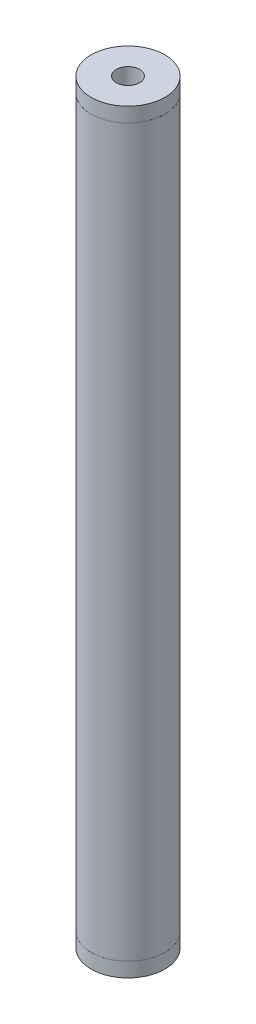
ISO-10303-21;
HEADER;
FILE_DESCRIPTION(('STEP AP214'),'2;1');
FILE_NAME('part.step','',(''),(''),'','','');
FILE_SCHEMA(('AUTOMOTIVE_DESIGN { 1 0 10303 214 1 1 1 1 }'));
ENDSEC;
DATA;
#1=APPLICATION_CONTEXT('core data for automotive mechanical design processes');
#2=APPLICATION_PROTOCOL_DEFINITION('international standard','automotive_design',2000,#1);
#3=PRODUCT_CONTEXT('',#1,'mechanical');
#4=PRODUCT('Part','Part','',(#3));
#5=PRODUCT_RELATED_PRODUCT_CATEGORY('part','',(#4));
#6=PRODUCT_DEFINITION_FORMATION('','',#4);
#7=PRODUCT_DEFINITION_CONTEXT('part definition',#1,'design');
#8=PRODUCT_DEFINITION('design','',#6,#7);
#9=PRODUCT_DEFINITION_SHAPE('','',#8);
#10=(LENGTH_UNIT() NAMED_UNIT(*) SI_UNIT(.MILLI.,.METRE.));
#11=(NAMED_UNIT(*) PLANE_ANGLE_UNIT() SI_UNIT($,.RADIAN.));
#12=(NAMED_UNIT(*) SI_UNIT($,.STERADIAN.) SOLID_ANGLE_UNIT());
#13=UNCERTAINTY_MEASURE_WITH_UNIT(LENGTH_MEASURE(1.E-05),#10,'distance_accuracy_value','');
#14=(GEOMETRIC_REPRESENTATION_CONTEXT(3) GLOBAL_UNCERTAINTY_ASSIGNED_CONTEXT((#13)) GLOBAL_UNIT_ASSIGNED_CONTEXT((#10,
#11,#12)) REPRESENTATION_CONTEXT('',''));
#15=CARTESIAN_POINT('',(0.,0.,0.));
#16=DIRECTION('',(0.,0.,1.));
#17=DIRECTION('',(1.,0.,0.));
#18=AXIS2_PLACEMENT_3D('',#15,#16,#17);
#19=CARTESIAN_POINT('',(25.4,-10.,0.));
#20=DIRECTION('',(0.,-1.,0.));
#21=DIRECTION('',(0.,0.,-1.));
#22=AXIS2_PLACEMENT_3D('',#19,#20,#21);
#23=PLANE('',#22);
#24=CARTESIAN_POINT('',(0.,-10.,0.));
#25=DIRECTION('',(0.,-1.,0.));
#26=DIRECTION('',(0.,0.,-1.));
#27=AXIS2_PLACEMENT_3D('',#24,#25,#26);
#28=CIRCLE('',#27,25.4);
#29=CARTESIAN_POINT('',(0.,-10.,-25.4));
#30=VERTEX_POINT('',#29);
#31=EDGE_CURVE('E62',#30,#30,#28,.T.);
#32=ORIENTED_EDGE('',*,*,#31,.T.);
#33=EDGE_LOOP('',(#32));
#34=FACE_BOUND('',#33,.T.);
#35=CARTESIAN_POINT('',(0.,-10.,0.));
#36=DIRECTION('',(0.,-1.,0.));
#37=DIRECTION('',(0.,0.,-1.));
#38=AXIS2_PLACEMENT_3D('',#35,#36,#37);
#39=CIRCLE('',#38,8.);
#40=CARTESIAN_POINT('',(0.,-10.,-8.));
#41=VERTEX_POINT('',#40);
#42=EDGE_CURVE('E11',#41,#41,#39,.T.);
#43=ORIENTED_EDGE('',*,*,#42,.F.);
#44=EDGE_LOOP('',(#43));
#45=FACE_BOUND('',#44,.T.);
#46=ADVANCED_FACE('F40',(#34,#45),#23,.T.);
#47=CARTESIAN_POINT('',(0.,0.,0.));
#48=DIRECTION('',(0.,-1.,0.));
#49=DIRECTION('',(0.,0.,-1.));
#50=AXIS2_PLACEMENT_3D('',#47,#48,#49);
#51=CYLINDRICAL_SURFACE('',#50,8.);
#52=ORIENTED_EDGE('',*,*,#42,.T.);
#53=EDGE_LOOP('',(#52));
#54=FACE_BOUND('',#53,.T.);
#55=CARTESIAN_POINT('',(0.,40.,0.));
#56=DIRECTION('',(0.,-1.,0.));
#57=DIRECTION('',(0.,0.,-1.));
#58=AXIS2_PLACEMENT_3D('',#55,#56,#57);
#59=CIRCLE('',#58,8.00000000000001);
#60=CARTESIAN_POINT('',(0.,40.,-8.00000000000001));
#61=VERTEX_POINT('',#60);
#62=EDGE_CURVE('E46',#61,#61,#59,.T.);
#63=ORIENTED_EDGE('',*,*,#62,.F.);
#64=EDGE_LOOP('',(#63));
#65=FACE_BOUND('',#64,.T.);
#66=ADVANCED_FACE('F80',(#54,#65),#51,.F.);
#67=CARTESIAN_POINT('',(8.00000000000001,40.,0.));
#68=DIRECTION('',(0.,1.,0.));
#69=DIRECTION('',(0.,0.,1.));
#70=AXIS2_PLACEMENT_3D('',#67,#68,#69);
#71=PLANE('',#70);
#72=ORIENTED_EDGE('',*,*,#62,.T.);
#73=EDGE_LOOP('',(#72));
#74=FACE_BOUND('',#73,.T.);
#75=CARTESIAN_POINT('',(0.,40.,0.));
#76=DIRECTION('',(0.,-1.,0.));
#77=DIRECTION('',(0.,0.,-1.));
#78=AXIS2_PLACEMENT_3D('',#75,#76,#77);
#79=CIRCLE('',#78,21.65);
#80=CARTESIAN_POINT('',(0.,40.,-21.65));
#81=VERTEX_POINT('',#80);
#82=EDGE_CURVE('E50',#81,#81,#79,.T.);
#83=ORIENTED_EDGE('',*,*,#82,.F.);
#84=EDGE_LOOP('',(#83));
#85=FACE_BOUND('',#84,.T.);
#86=ADVANCED_FACE('F84',(#74,#85),#71,.T.);
#87=CARTESIAN_POINT('',(0.,0.,0.));
#88=DIRECTION('',(0.,-1.,0.));
#89=DIRECTION('',(0.,0.,-1.));
#90=AXIS2_PLACEMENT_3D('',#87,#88,#89);
#91=CYLINDRICAL_SURFACE('',#90,21.65);
#92=ORIENTED_EDGE('',*,*,#82,.T.);
#93=EDGE_LOOP('',(#92));
#94=FACE_BOUND('',#93,.T.);
#95=CARTESIAN_POINT('',(0.,0.,0.));
#96=DIRECTION('',(0.,-1.,0.));
#97=DIRECTION('',(0.,0.,-1.));
#98=AXIS2_PLACEMENT_3D('',#95,#96,#97);
#99=CIRCLE('',#98,21.65);
#100=CARTESIAN_POINT('',(0.,0.,-21.65));
#101=VERTEX_POINT('',#100);
#102=EDGE_CURVE('E54',#101,#101,#99,.T.);
#103=ORIENTED_EDGE('',*,*,#102,.F.);
#104=EDGE_LOOP('',(#103));
#105=FACE_BOUND('',#104,.T.);
#106=ADVANCED_FACE('F76',(#94,#105),#91,.T.);
#107=CARTESIAN_POINT('',(21.65,0.,0.));
#108=DIRECTION('',(0.,1.,0.));
#109=DIRECTION('',(0.,0.,1.));
#110=AXIS2_PLACEMENT_3D('',#107,#108,#109);
#111=PLANE('',#110);
#112=ORIENTED_EDGE('',*,*,#102,.T.);
#113=EDGE_LOOP('',(#112));
#114=FACE_BOUND('',#113,.T.);
#115=CARTESIAN_POINT('',(0.,0.,0.));
#116=DIRECTION('',(0.,-1.,0.));
#117=DIRECTION('',(0.,0.,-1.));
#118=AXIS2_PLACEMENT_3D('',#115,#116,#117);
#119=CIRCLE('',#118,25.4);
#120=CARTESIAN_POINT('',(0.,0.,-25.4));
#121=VERTEX_POINT('',#120);
#122=EDGE_CURVE('E59',#121,#121,#119,.T.);
#123=ORIENTED_EDGE('',*,*,#122,.F.);
#124=EDGE_LOOP('',(#123));
#125=FACE_BOUND('',#124,.T.);
#126=ADVANCED_FACE('F70',(#114,#125),#111,.T.);
#127=CARTESIAN_POINT('',(0.,0.,0.));
#128=DIRECTION('',(0.,-1.,0.));
#129=DIRECTION('',(0.,0.,-1.));
#130=AXIS2_PLACEMENT_3D('',#127,#128,#129);
#131=CYLINDRICAL_SURFACE('',#130,25.4);
#132=ORIENTED_EDGE('',*,*,#122,.T.);
#133=EDGE_LOOP('',(#132));
#134=FACE_BOUND('',#133,.T.);
#135=ORIENTED_EDGE('',*,*,#31,.F.);
#136=EDGE_LOOP('',(#135));
#137=FACE_BOUND('',#136,.T.);
#138=ADVANCED_FACE('F68',(#134,#137),#131,.T.);
#139=CLOSED_SHELL('',(#46,#66,#86,#106,#126,#138));
#140=MANIFOLD_SOLID_BREP('B2',#139);
#141=CARTESIAN_POINT('',(21.65,500.,0.));
#142=DIRECTION('',(0.,-1.,0.));
#143=DIRECTION('',(0.,0.,-1.));
#144=AXIS2_PLACEMENT_3D('',#141,#142,#143);
#145=PLANE('',#144);
#146=CARTESIAN_POINT('',(0.,500.,0.));
#147=DIRECTION('',(0.,-1.,0.));
#148=DIRECTION('',(0.,0.,-1.));
#149=AXIS2_PLACEMENT_3D('',#146,#147,#148);
#150=CIRCLE('',#149,25.4);
#151=CARTESIAN_POINT('',(0.,500.,-25.4));
#152=VERTEX_POINT('',#151);
#153=EDGE_CURVE('E39',#152,#152,#150,.T.);
#154=ORIENTED_EDGE('',*,*,#153,.T.);
#155=EDGE_LOOP('',(#154));
#156=FACE_BOUND('',#155,.T.);
#157=CARTESIAN_POINT('',(0.,500.,0.));
#158=DIRECTION('',(0.,-1.,0.));
#159=DIRECTION('',(0.,0.,-1.));
#160=AXIS2_PLACEMENT_3D('',#157,#158,#159);
#161=CIRCLE('',#160,21.65);
#162=CARTESIAN_POINT('',(0.,500.,-21.65));
#163=VERTEX_POINT('',#162);
#164=EDGE_CURVE('E161',#163,#163,#161,.T.);
#165=ORIENTED_EDGE('',*,*,#164,.F.);
#166=EDGE_LOOP('',(#165));
#167=FACE_BOUND('',#166,.T.);
#168=ADVANCED_FACE('F139',(#156,#167),#145,.T.);
#169=CARTESIAN_POINT('',(0.,0.,0.));
#170=DIRECTION('',(0.,-1.,0.));
#171=DIRECTION('',(0.,0.,-1.));
#172=AXIS2_PLACEMENT_3D('',#169,#170,#171);
#173=CYLINDRICAL_SURFACE('',#172,25.4);
#174=CARTESIAN_POINT('',(0.,510.,0.));
#175=DIRECTION('',(0.,-1.,0.));
#176=DIRECTION('',(0.,0.,-1.));
#177=AXIS2_PLACEMENT_3D('',#174,#175,#176);
#178=CIRCLE('',#177,25.4);
#179=CARTESIAN_POINT('',(0.,510.,-25.4));
#180=VERTEX_POINT('',#179);
#181=EDGE_CURVE('E145',#180,#180,#178,.T.);
#182=ORIENTED_EDGE('',*,*,#181,.T.);
#183=EDGE_LOOP('',(#182));
#184=FACE_BOUND('',#183,.T.);
#185=ORIENTED_EDGE('',*,*,#153,.F.);
#186=EDGE_LOOP('',(#185));
#187=FACE_BOUND('',#186,.T.);
#188=ADVANCED_FACE('F169',(#184,#187),#173,.T.);
#189=CARTESIAN_POINT('',(25.4,510.,0.));
#190=DIRECTION('',(0.,1.,0.));
#191=DIRECTION('',(0.,0.,1.));
#192=AXIS2_PLACEMENT_3D('',#189,#190,#191);
#193=PLANE('',#192);
#194=CARTESIAN_POINT('',(0.,510.,0.));
#195=DIRECTION('',(0.,-1.,0.));
#196=DIRECTION('',(0.,0.,-1.));
#197=AXIS2_PLACEMENT_3D('',#194,#195,#196);
#198=CIRCLE('',#197,8.00000000000009);
#199=CARTESIAN_POINT('',(0.,510.,-8.00000000000009));
#200=VERTEX_POINT('',#199);
#201=EDGE_CURVE('E149',#200,#200,#198,.T.);
#202=ORIENTED_EDGE('',*,*,#201,.T.);
#203=EDGE_LOOP('',(#202));
#204=FACE_BOUND('',#203,.T.);
#205=ORIENTED_EDGE('',*,*,#181,.F.);
#206=EDGE_LOOP('',(#205));
#207=FACE_BOUND('',#206,.T.);
#208=ADVANCED_FACE('F173',(#204,#207),#193,.T.);
#209=CARTESIAN_POINT('',(0.,0.,0.));
#210=DIRECTION('',(0.,-1.,0.));
#211=DIRECTION('',(0.,0.,-1.));
#212=AXIS2_PLACEMENT_3D('',#209,#210,#211);
#213=CYLINDRICAL_SURFACE('',#212,8.00000000000009);
#214=CARTESIAN_POINT('',(0.,460.,0.));
#215=DIRECTION('',(0.,-1.,0.));
#216=DIRECTION('',(0.,0.,-1.));
#217=AXIS2_PLACEMENT_3D('',#214,#215,#216);
#218=CIRCLE('',#217,8.00000000000009);
#219=CARTESIAN_POINT('',(0.,460.,-8.00000000000009));
#220=VERTEX_POINT('',#219);
#221=EDGE_CURVE('E153',#220,#220,#218,.T.);
#222=ORIENTED_EDGE('',*,*,#221,.T.);
#223=EDGE_LOOP('',(#222));
#224=FACE_BOUND('',#223,.T.);
#225=ORIENTED_EDGE('',*,*,#201,.F.);
#226=EDGE_LOOP('',(#225));
#227=FACE_BOUND('',#226,.T.);
#228=ADVANCED_FACE('F177',(#224,#227),#213,.F.);
#229=CARTESIAN_POINT('',(8.00000000000009,460.,0.));
#230=DIRECTION('',(0.,-1.,0.));
#231=DIRECTION('',(0.,0.,-1.));
#232=AXIS2_PLACEMENT_3D('',#229,#230,#231);
#233=PLANE('',#232);
#234=CARTESIAN_POINT('',(0.,460.,0.));
#235=DIRECTION('',(0.,-1.,0.));
#236=DIRECTION('',(0.,0.,-1.));
#237=AXIS2_PLACEMENT_3D('',#234,#235,#236);
#238=CIRCLE('',#237,21.65);
#239=CARTESIAN_POINT('',(0.,460.,-21.65));
#240=VERTEX_POINT('',#239);
#241=EDGE_CURVE('E158',#240,#240,#238,.T.);
#242=ORIENTED_EDGE('',*,*,#241,.T.);
#243=EDGE_LOOP('',(#242));
#244=FACE_BOUND('',#243,.T.);
#245=ORIENTED_EDGE('',*,*,#221,.F.);
#246=EDGE_LOOP('',(#245));
#247=FACE_BOUND('',#246,.T.);
#248=ADVANCED_FACE('F184',(#244,#247),#233,.T.);
#249=CARTESIAN_POINT('',(0.,0.,0.));
#250=DIRECTION('',(0.,-1.,0.));
#251=DIRECTION('',(0.,0.,-1.));
#252=AXIS2_PLACEMENT_3D('',#249,#250,#251);
#253=CYLINDRICAL_SURFACE('',#252,21.65);
#254=ORIENTED_EDGE('',*,*,#164,.T.);
#255=EDGE_LOOP('',(#254));
#256=FACE_BOUND('',#255,.T.);
#257=ORIENTED_EDGE('',*,*,#241,.F.);
#258=EDGE_LOOP('',(#257));
#259=FACE_BOUND('',#258,.T.);
#260=ADVANCED_FACE('F165',(#256,#259),#253,.T.);
#261=CLOSED_SHELL('',(#168,#188,#208,#228,#248,#260));
#262=MANIFOLD_SOLID_BREP('B6',#261);
#263=CARTESIAN_POINT('',(0.,500.,0.));
#264=DIRECTION('',(0.,1.,0.));
#265=DIRECTION('',(0.,0.,1.));
#266=AXIS2_PLACEMENT_3D('',#263,#264,#265);
#267=PLANE('',#266);
#268=CARTESIAN_POINT('',(0.,500.,0.));
#269=DIRECTION('',(0.,1.,0.));
#270=DIRECTION('',(0.,0.,1.));
#271=AXIS2_PLACEMENT_3D('',#268,#269,#270);
#272=CIRCLE('',#271,25.4);
#273=CARTESIAN_POINT('',(0.,500.,25.4));
#274=VERTEX_POINT('',#273);
#275=EDGE_CURVE('E138',#274,#274,#272,.T.);
#276=ORIENTED_EDGE('',*,*,#275,.T.);
#277=EDGE_LOOP('',(#276));
#278=FACE_BOUND('',#277,.T.);
#279=CARTESIAN_POINT('',(0.,500.,0.));
#280=DIRECTION('',(0.,1.,0.));
#281=DIRECTION('',(0.,0.,1.));
#282=AXIS2_PLACEMENT_3D('',#279,#280,#281);
#283=CIRCLE('',#282,21.65);
#284=CARTESIAN_POINT('',(0.,500.,21.65));
#285=VERTEX_POINT('',#284);
#286=EDGE_CURVE('E242',#285,#285,#283,.T.);
#287=ORIENTED_EDGE('',*,*,#286,.F.);
#288=EDGE_LOOP('',(#287));
#289=FACE_BOUND('',#288,.T.);
#290=ADVANCED_FACE('F231',(#278,#289),#267,.T.);
#291=CARTESIAN_POINT('',(0.,0.,0.));
#292=DIRECTION('',(0.,1.,0.));
#293=DIRECTION('',(0.,0.,1.));
#294=AXIS2_PLACEMENT_3D('',#291,#292,#293);
#295=PLANE('',#294);
#296=CARTESIAN_POINT('',(0.,0.,0.));
#297=DIRECTION('',(0.,1.,0.));
#298=DIRECTION('',(0.,0.,1.));
#299=AXIS2_PLACEMENT_3D('',#296,#297,#298);
#300=CIRCLE('',#299,25.4);
#301=CARTESIAN_POINT('',(0.,0.,25.4));
#302=VERTEX_POINT('',#301);
#303=EDGE_CURVE('E235',#302,#302,#300,.T.);
#304=ORIENTED_EDGE('',*,*,#303,.F.);
#305=EDGE_LOOP('',(#304));
#306=FACE_BOUND('',#305,.T.);
#307=CARTESIAN_POINT('',(0.,0.,0.));
#308=DIRECTION('',(0.,1.,0.));
#309=DIRECTION('',(0.,0.,1.));
#310=AXIS2_PLACEMENT_3D('',#307,#308,#309);
#311=CIRCLE('',#310,21.65);
#312=CARTESIAN_POINT('',(0.,0.,21.65));
#313=VERTEX_POINT('',#312);
#314=EDGE_CURVE('E244',#313,#313,#311,.T.);
#315=ORIENTED_EDGE('',*,*,#314,.T.);
#316=EDGE_LOOP('',(#315));
#317=FACE_BOUND('',#316,.T.);
#318=ADVANCED_FACE('F254',(#306,#317),#295,.F.);
#319=CARTESIAN_POINT('',(0.,500.,0.));
#320=DIRECTION('',(0.,-1.,0.));
#321=DIRECTION('',(0.,0.,-1.));
#322=AXIS2_PLACEMENT_3D('',#319,#320,#321);
#323=CYLINDRICAL_SURFACE('',#322,25.4);
#324=ORIENTED_EDGE('',*,*,#275,.F.);
#325=EDGE_LOOP('',(#324));
#326=FACE_BOUND('',#325,.T.);
#327=ORIENTED_EDGE('',*,*,#303,.T.);
#328=EDGE_LOOP('',(#327));
#329=FACE_BOUND('',#328,.T.);
#330=ADVANCED_FACE('F233',(#326,#329),#323,.T.);
#331=CARTESIAN_POINT('',(0.,500.,0.));
#332=DIRECTION('',(0.,-1.,0.));
#333=DIRECTION('',(0.,0.,-1.));
#334=AXIS2_PLACEMENT_3D('',#331,#332,#333);
#335=CYLINDRICAL_SURFACE('',#334,21.65);
#336=ORIENTED_EDGE('',*,*,#286,.T.);
#337=EDGE_LOOP('',(#336));
#338=FACE_BOUND('',#337,.T.);
#339=ORIENTED_EDGE('',*,*,#314,.F.);
#340=EDGE_LOOP('',(#339));
#341=FACE_BOUND('',#340,.T.);
#342=ADVANCED_FACE('F250',(#338,#341),#335,.F.);
#343=CLOSED_SHELL('',(#290,#318,#330,#342));
#344=MANIFOLD_SOLID_BREP('B34',#343);
#345=ADVANCED_BREP_SHAPE_REPRESENTATION('',(#18,#140,#262,#344),#14);
#346=SHAPE_DEFINITION_REPRESENTATION(#9,#345);
ENDSEC;
END-ISO-10303-21;
